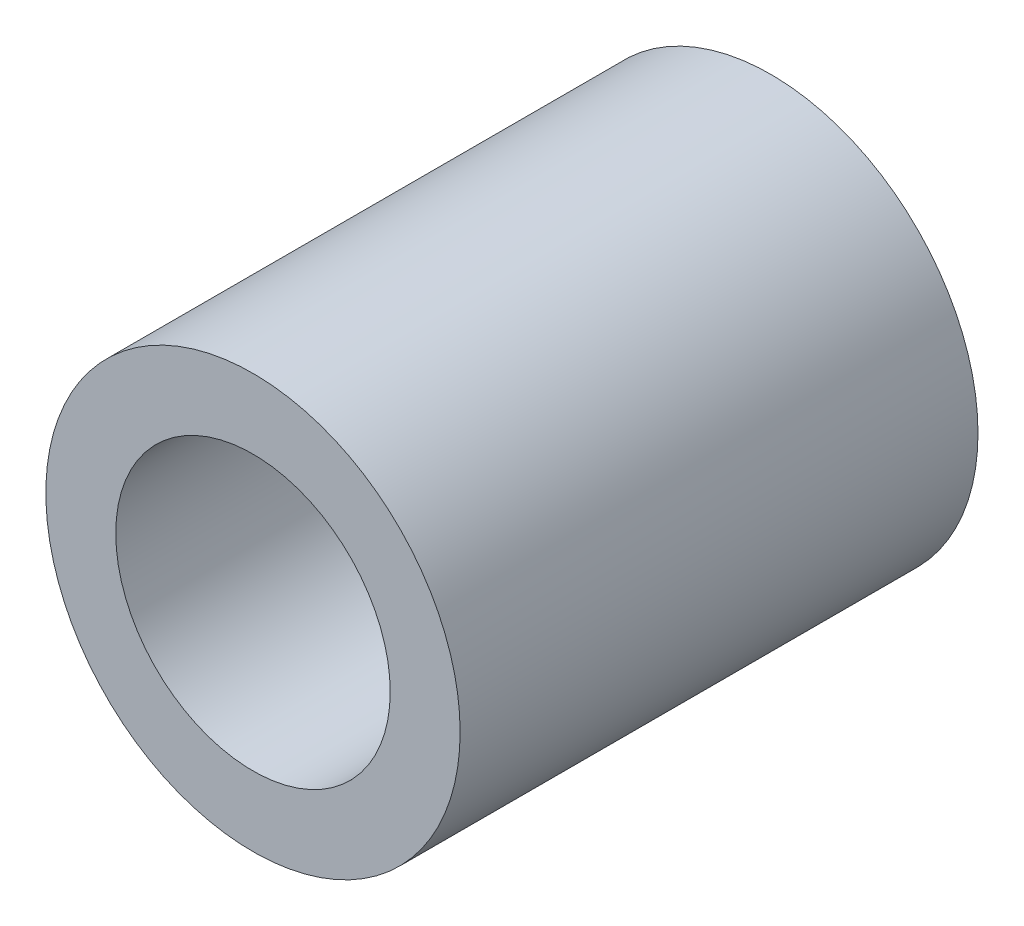
ISO-10303-21;
HEADER;
FILE_DESCRIPTION(('STEP AP214'),'2;1');
FILE_NAME('part.step','',(''),(''),'','','');
FILE_SCHEMA(('AUTOMOTIVE_DESIGN { 1 0 10303 214 1 1 1 1 }'));
ENDSEC;
DATA;
#1=APPLICATION_CONTEXT('core data for automotive mechanical design processes');
#2=APPLICATION_PROTOCOL_DEFINITION('international standard','automotive_design',2000,#1);
#3=PRODUCT_CONTEXT('',#1,'mechanical');
#4=PRODUCT('Part','Part','',(#3));
#5=PRODUCT_RELATED_PRODUCT_CATEGORY('part','',(#4));
#6=PRODUCT_DEFINITION_FORMATION('','',#4);
#7=PRODUCT_DEFINITION_CONTEXT('part definition',#1,'design');
#8=PRODUCT_DEFINITION('design','',#6,#7);
#9=PRODUCT_DEFINITION_SHAPE('','',#8);
#10=(LENGTH_UNIT() NAMED_UNIT(*) SI_UNIT(.MILLI.,.METRE.));
#11=(NAMED_UNIT(*) PLANE_ANGLE_UNIT() SI_UNIT($,.RADIAN.));
#12=(NAMED_UNIT(*) SI_UNIT($,.STERADIAN.) SOLID_ANGLE_UNIT());
#13=UNCERTAINTY_MEASURE_WITH_UNIT(LENGTH_MEASURE(1.E-05),#10,'distance_accuracy_value','');
#14=(GEOMETRIC_REPRESENTATION_CONTEXT(3) GLOBAL_UNCERTAINTY_ASSIGNED_CONTEXT((#13)) GLOBAL_UNIT_ASSIGNED_CONTEXT((#10,
#11,#12)) REPRESENTATION_CONTEXT('',''));
#15=CARTESIAN_POINT('',(0.,0.,0.));
#16=DIRECTION('',(0.,0.,1.));
#17=DIRECTION('',(1.,0.,0.));
#18=AXIS2_PLACEMENT_3D('',#15,#16,#17);
#19=CARTESIAN_POINT('',(0.,0.,-5.));
#20=DIRECTION('',(0.,0.,1.));
#21=DIRECTION('',(1.,0.,0.));
#22=AXIS2_PLACEMENT_3D('',#19,#20,#21);
#23=PLANE('',#22);
#24=CARTESIAN_POINT('',(0.,0.,-5.));
#25=DIRECTION('',(0.,0.,1.));
#26=DIRECTION('',(1.,0.,0.));
#27=AXIS2_PLACEMENT_3D('',#24,#25,#26);
#28=CIRCLE('',#27,2.65);
#29=CARTESIAN_POINT('',(2.65,0.,-5.));
#30=VERTEX_POINT('',#29);
#31=EDGE_CURVE('E58',#30,#30,#28,.T.);
#32=ORIENTED_EDGE('',*,*,#31,.T.);
#33=EDGE_LOOP('',(#32));
#34=FACE_BOUND('',#33,.T.);
#35=CARTESIAN_POINT('',(0.,0.,-5.));
#36=DIRECTION('',(0.,0.,1.));
#37=DIRECTION('',(1.,0.,0.));
#38=AXIS2_PLACEMENT_3D('',#35,#36,#37);
#39=CIRCLE('',#38,4.);
#40=CARTESIAN_POINT('',(4.,0.,-5.));
#41=VERTEX_POINT('',#40);
#42=EDGE_CURVE('E64',#41,#41,#39,.T.);
#43=ORIENTED_EDGE('',*,*,#42,.F.);
#44=EDGE_LOOP('',(#43));
#45=FACE_BOUND('',#44,.T.);
#46=ADVANCED_FACE('F17',(#34,#45),#23,.F.);
#47=CARTESIAN_POINT('',(0.,0.,5.));
#48=DIRECTION('',(0.,0.,1.));
#49=DIRECTION('',(1.,0.,0.));
#50=AXIS2_PLACEMENT_3D('',#47,#48,#49);
#51=PLANE('',#50);
#52=CARTESIAN_POINT('',(0.,0.,5.));
#53=DIRECTION('',(0.,0.,1.));
#54=DIRECTION('',(1.,0.,0.));
#55=AXIS2_PLACEMENT_3D('',#52,#53,#54);
#56=CIRCLE('',#55,2.65);
#57=CARTESIAN_POINT('',(2.65,0.,5.));
#58=VERTEX_POINT('',#57);
#59=EDGE_CURVE('E57',#58,#58,#56,.T.);
#60=ORIENTED_EDGE('',*,*,#59,.F.);
#61=EDGE_LOOP('',(#60));
#62=FACE_BOUND('',#61,.T.);
#63=CARTESIAN_POINT('',(0.,0.,5.));
#64=DIRECTION('',(0.,0.,1.));
#65=DIRECTION('',(1.,0.,0.));
#66=AXIS2_PLACEMENT_3D('',#63,#64,#65);
#67=CIRCLE('',#66,4.);
#68=CARTESIAN_POINT('',(4.,0.,5.));
#69=VERTEX_POINT('',#68);
#70=EDGE_CURVE('E11',#69,#69,#67,.T.);
#71=ORIENTED_EDGE('',*,*,#70,.T.);
#72=EDGE_LOOP('',(#71));
#73=FACE_BOUND('',#72,.T.);
#74=ADVANCED_FACE('F75',(#62,#73),#51,.T.);
#75=CARTESIAN_POINT('',(0.,0.,5.));
#76=DIRECTION('',(0.,0.,-1.));
#77=DIRECTION('',(-1.,0.,0.));
#78=AXIS2_PLACEMENT_3D('',#75,#76,#77);
#79=CYLINDRICAL_SURFACE('',#78,4.);
#80=ORIENTED_EDGE('',*,*,#42,.T.);
#81=DIRECTION('',(0.,0.,1.));
#82=VECTOR('',#81,1.);
#83=CARTESIAN_POINT('',(4.,0.,5.));
#84=LINE('',#83,#82);
#85=EDGE_CURVE('E20',#41,#69,#84,.T.);
#86=ORIENTED_EDGE('',*,*,#85,.T.);
#87=ORIENTED_EDGE('',*,*,#70,.F.);
#88=ORIENTED_EDGE('',*,*,#85,.F.);
#89=EDGE_LOOP('',(#80,#86,#87,#88));
#90=FACE_BOUND('',#89,.T.);
#91=ADVANCED_FACE('F73',(#90),#79,.T.);
#92=CARTESIAN_POINT('',(0.,0.,5.));
#93=DIRECTION('',(0.,0.,-1.));
#94=DIRECTION('',(-1.,0.,0.));
#95=AXIS2_PLACEMENT_3D('',#92,#93,#94);
#96=CYLINDRICAL_SURFACE('',#95,2.65);
#97=ORIENTED_EDGE('',*,*,#59,.T.);
#98=DIRECTION('',(0.,0.,-1.));
#99=VECTOR('',#98,1.);
#100=CARTESIAN_POINT('',(2.65,0.,5.));
#101=LINE('',#100,#99);
#102=EDGE_CURVE('E54',#58,#30,#101,.T.);
#103=ORIENTED_EDGE('',*,*,#102,.T.);
#104=ORIENTED_EDGE('',*,*,#31,.F.);
#105=ORIENTED_EDGE('',*,*,#102,.F.);
#106=EDGE_LOOP('',(#97,#103,#104,#105));
#107=FACE_BOUND('',#106,.T.);
#108=ADVANCED_FACE('F55',(#107),#96,.F.);
#109=CLOSED_SHELL('',(#46,#74,#91,#108));
#110=MANIFOLD_SOLID_BREP('B1',#109);
#111=ADVANCED_BREP_SHAPE_REPRESENTATION('',(#18,#110),#14);
#112=SHAPE_DEFINITION_REPRESENTATION(#9,#111);
ENDSEC;
END-ISO-10303-21;
